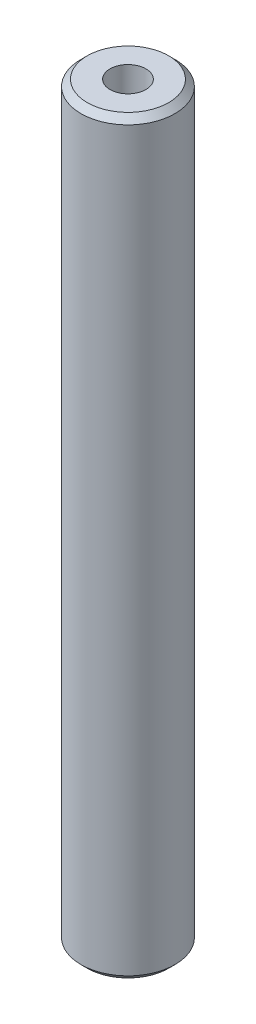
ISO-10303-21;
HEADER;
FILE_DESCRIPTION(('STEP AP214'),'2;1');
FILE_NAME('part.step','',(''),(''),'','','');
FILE_SCHEMA(('AUTOMOTIVE_DESIGN { 1 0 10303 214 1 1 1 1 }'));
ENDSEC;
DATA;
#1=APPLICATION_CONTEXT('core data for automotive mechanical design processes');
#2=APPLICATION_PROTOCOL_DEFINITION('international standard','automotive_design',2000,#1);
#3=PRODUCT_CONTEXT('',#1,'mechanical');
#4=PRODUCT('Part','Part','',(#3));
#5=PRODUCT_RELATED_PRODUCT_CATEGORY('part','',(#4));
#6=PRODUCT_DEFINITION_FORMATION('','',#4);
#7=PRODUCT_DEFINITION_CONTEXT('part definition',#1,'design');
#8=PRODUCT_DEFINITION('design','',#6,#7);
#9=PRODUCT_DEFINITION_SHAPE('','',#8);
#10=(LENGTH_UNIT() NAMED_UNIT(*) SI_UNIT(.MILLI.,.METRE.));
#11=(NAMED_UNIT(*) PLANE_ANGLE_UNIT() SI_UNIT($,.RADIAN.));
#12=(NAMED_UNIT(*) SI_UNIT($,.STERADIAN.) SOLID_ANGLE_UNIT());
#13=UNCERTAINTY_MEASURE_WITH_UNIT(LENGTH_MEASURE(1.E-05),#10,'distance_accuracy_value','');
#14=(GEOMETRIC_REPRESENTATION_CONTEXT(3) GLOBAL_UNCERTAINTY_ASSIGNED_CONTEXT((#13)) GLOBAL_UNIT_ASSIGNED_CONTEXT((#10,
#11,#12)) REPRESENTATION_CONTEXT('',''));
#15=CARTESIAN_POINT('',(0.,0.,0.));
#16=DIRECTION('',(0.,0.,1.));
#17=DIRECTION('',(1.,0.,0.));
#18=AXIS2_PLACEMENT_3D('',#15,#16,#17);
#19=CARTESIAN_POINT('',(0.,598.097056934792,0.));
#20=DIRECTION('',(0.,-1.,0.));
#21=DIRECTION('',(0.,0.,-1.));
#22=AXIS2_PLACEMENT_3D('',#19,#20,#21);
#23=CYLINDRICAL_SURFACE('',#22,37.5);
#24=CARTESIAN_POINT('',(0.,593.037470691026,0.));
#25=DIRECTION('',(0.,1.,0.));
#26=DIRECTION('',(0.,0.,1.));
#27=AXIS2_PLACEMENT_3D('',#24,#25,#26);
#28=CIRCLE('',#27,37.5);
#29=CARTESIAN_POINT('',(0.,593.037470691026,37.5));
#30=VERTEX_POINT('',#29);
#31=EDGE_CURVE('E50',#30,#30,#28,.F.);
#32=ORIENTED_EDGE('',*,*,#31,.T.);
#33=EDGE_LOOP('',(#32));
#34=FACE_BOUND('',#33,.T.);
#35=CARTESIAN_POINT('',(0.,5.05958624376601,0.));
#36=DIRECTION('',(0.,1.,0.));
#37=DIRECTION('',(0.,0.,1.));
#38=AXIS2_PLACEMENT_3D('',#35,#36,#37);
#39=CIRCLE('',#38,37.5);
#40=CARTESIAN_POINT('',(0.,5.05958624376601,37.5));
#41=VERTEX_POINT('',#40);
#42=EDGE_CURVE('E51',#41,#41,#39,.T.);
#43=ORIENTED_EDGE('',*,*,#42,.T.);
#44=EDGE_LOOP('',(#43));
#45=FACE_BOUND('',#44,.T.);
#46=ADVANCED_FACE('F39',(#34,#45),#23,.T.);
#47=CARTESIAN_POINT('',(0.,598.097056934792,0.));
#48=DIRECTION('',(0.,1.,0.));
#49=DIRECTION('',(0.,0.,1.));
#50=AXIS2_PLACEMENT_3D('',#47,#48,#49);
#51=PLANE('',#50);
#52=CARTESIAN_POINT('',(0.,598.097056934792,0.));
#53=DIRECTION('',(0.,1.,0.));
#54=DIRECTION('',(0.,0.,1.));
#55=AXIS2_PLACEMENT_3D('',#52,#53,#54);
#56=CIRCLE('',#55,32.4404137562341);
#57=CARTESIAN_POINT('',(0.,598.097056934792,32.4404137562341));
#58=VERTEX_POINT('',#57);
#59=EDGE_CURVE('E54',#58,#58,#56,.T.);
#60=ORIENTED_EDGE('',*,*,#59,.T.);
#61=EDGE_LOOP('',(#60));
#62=FACE_BOUND('',#61,.T.);
#63=CARTESIAN_POINT('',(0.,598.097056934792,0.));
#64=DIRECTION('',(0.,1.,0.));
#65=DIRECTION('',(0.,0.,1.));
#66=AXIS2_PLACEMENT_3D('',#63,#64,#65);
#67=CIRCLE('',#66,14.3342229480437);
#68=CARTESIAN_POINT('',(0.,598.097056934792,14.3342229480437));
#69=VERTEX_POINT('',#68);
#70=EDGE_CURVE('E58',#69,#69,#67,.T.);
#71=ORIENTED_EDGE('',*,*,#70,.F.);
#72=EDGE_LOOP('',(#71));
#73=FACE_BOUND('',#72,.T.);
#74=ADVANCED_FACE('F69',(#62,#73),#51,.T.);
#75=CARTESIAN_POINT('',(0.,0.,0.));
#76=DIRECTION('',(0.,1.,0.));
#77=DIRECTION('',(0.,0.,1.));
#78=AXIS2_PLACEMENT_3D('',#75,#76,#77);
#79=PLANE('',#78);
#80=CARTESIAN_POINT('',(0.,0.,0.));
#81=DIRECTION('',(0.,1.,0.));
#82=DIRECTION('',(0.,0.,1.));
#83=AXIS2_PLACEMENT_3D('',#80,#81,#82);
#84=CIRCLE('',#83,32.440413756234);
#85=CARTESIAN_POINT('',(0.,0.,32.440413756234));
#86=VERTEX_POINT('',#85);
#87=EDGE_CURVE('E10',#86,#86,#84,.F.);
#88=ORIENTED_EDGE('',*,*,#87,.T.);
#89=EDGE_LOOP('',(#88));
#90=FACE_BOUND('',#89,.T.);
#91=CARTESIAN_POINT('',(0.,0.,0.));
#92=DIRECTION('',(0.,1.,0.));
#93=DIRECTION('',(0.,0.,1.));
#94=AXIS2_PLACEMENT_3D('',#91,#92,#93);
#95=CIRCLE('',#94,14.3342229480437);
#96=CARTESIAN_POINT('',(0.,0.,14.3342229480437));
#97=VERTEX_POINT('',#96);
#98=EDGE_CURVE('E63',#97,#97,#95,.T.);
#99=ORIENTED_EDGE('',*,*,#98,.T.);
#100=EDGE_LOOP('',(#99));
#101=FACE_BOUND('',#100,.T.);
#102=ADVANCED_FACE('F75',(#90,#101),#79,.F.);
#103=CARTESIAN_POINT('',(0.,598.097056934792,0.));
#104=DIRECTION('',(0.,-1.,0.));
#105=DIRECTION('',(0.,0.,-1.));
#106=AXIS2_PLACEMENT_3D('',#103,#104,#105);
#107=CYLINDRICAL_SURFACE('',#106,14.3342229480437);
#108=ORIENTED_EDGE('',*,*,#70,.T.);
#109=EDGE_LOOP('',(#108));
#110=FACE_BOUND('',#109,.T.);
#111=ORIENTED_EDGE('',*,*,#98,.F.);
#112=EDGE_LOOP('',(#111));
#113=FACE_BOUND('',#112,.T.);
#114=ADVANCED_FACE('F70',(#110,#113),#107,.F.);
#115=CARTESIAN_POINT('',(0.,598.097056934792,0.));
#116=DIRECTION('',(0.,-1.,0.));
#117=DIRECTION('',(0.,0.,-1.));
#118=AXIS2_PLACEMENT_3D('',#115,#116,#117);
#119=CONICAL_SURFACE('',#118,32.4404137562341,0.785398163397451);
#120=ORIENTED_EDGE('',*,*,#31,.F.);
#121=EDGE_LOOP('',(#120));
#122=FACE_BOUND('',#121,.T.);
#123=ORIENTED_EDGE('',*,*,#59,.F.);
#124=EDGE_LOOP('',(#123));
#125=FACE_BOUND('',#124,.T.);
#126=ADVANCED_FACE('F81',(#122,#125),#119,.T.);
#127=CARTESIAN_POINT('',(0.,5.05958624376601,0.));
#128=DIRECTION('',(0.,1.,0.));
#129=DIRECTION('',(0.,0.,1.));
#130=AXIS2_PLACEMENT_3D('',#127,#128,#129);
#131=CONICAL_SURFACE('',#130,37.5,0.785398163397446);
#132=ORIENTED_EDGE('',*,*,#87,.F.);
#133=EDGE_LOOP('',(#132));
#134=FACE_BOUND('',#133,.T.);
#135=ORIENTED_EDGE('',*,*,#42,.F.);
#136=EDGE_LOOP('',(#135));
#137=FACE_BOUND('',#136,.T.);
#138=ADVANCED_FACE('F45',(#134,#137),#131,.T.);
#139=CLOSED_SHELL('',(#46,#74,#102,#114,#126,#138));
#140=MANIFOLD_SOLID_BREP('B2',#139);
#141=ADVANCED_BREP_SHAPE_REPRESENTATION('',(#18,#140),#14);
#142=SHAPE_DEFINITION_REPRESENTATION(#9,#141);
ENDSEC;
END-ISO-10303-21;
